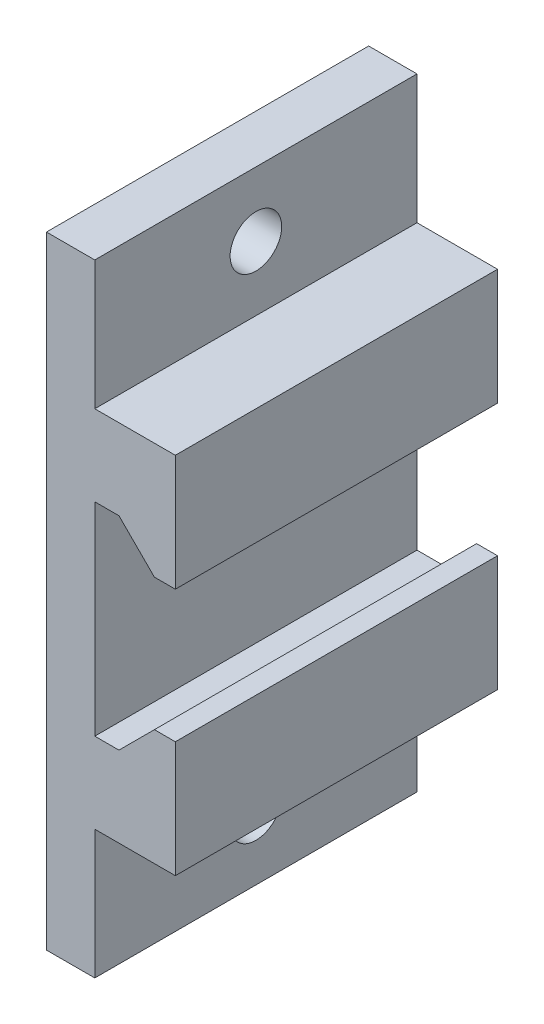
ISO-10303-21;
HEADER;
FILE_DESCRIPTION(('STEP AP214'),'2;1');
FILE_NAME('part.step','',(''),(''),'','','');
FILE_SCHEMA(('AUTOMOTIVE_DESIGN { 1 0 10303 214 1 1 1 1 }'));
ENDSEC;
DATA;
#1=APPLICATION_CONTEXT('core data for automotive mechanical design processes');
#2=APPLICATION_PROTOCOL_DEFINITION('international standard','automotive_design',2000,#1);
#3=PRODUCT_CONTEXT('',#1,'mechanical');
#4=PRODUCT('Part','Part','',(#3));
#5=PRODUCT_RELATED_PRODUCT_CATEGORY('part','',(#4));
#6=PRODUCT_DEFINITION_FORMATION('','',#4);
#7=PRODUCT_DEFINITION_CONTEXT('part definition',#1,'design');
#8=PRODUCT_DEFINITION('design','',#6,#7);
#9=PRODUCT_DEFINITION_SHAPE('','',#8);
#10=(LENGTH_UNIT() NAMED_UNIT(*) SI_UNIT(.MILLI.,.METRE.));
#11=(NAMED_UNIT(*) PLANE_ANGLE_UNIT() SI_UNIT($,.RADIAN.));
#12=(NAMED_UNIT(*) SI_UNIT($,.STERADIAN.) SOLID_ANGLE_UNIT());
#13=UNCERTAINTY_MEASURE_WITH_UNIT(LENGTH_MEASURE(1.E-05),#10,'distance_accuracy_value','');
#14=(GEOMETRIC_REPRESENTATION_CONTEXT(3) GLOBAL_UNCERTAINTY_ASSIGNED_CONTEXT((#13)) GLOBAL_UNIT_ASSIGNED_CONTEXT((#10,
#11,#12)) REPRESENTATION_CONTEXT('',''));
#15=CARTESIAN_POINT('',(0.,0.,0.));
#16=DIRECTION('',(0.,0.,1.));
#17=DIRECTION('',(1.,0.,0.));
#18=AXIS2_PLACEMENT_3D('',#15,#16,#17);
#19=CARTESIAN_POINT('',(3.,11.3,10.));
#20=DIRECTION('',(-1.,0.,0.));
#21=DIRECTION('',(0.,-1.,0.));
#22=AXIS2_PLACEMENT_3D('',#19,#20,#21);
#23=PLANE('',#22);
#24=CARTESIAN_POINT('',(3.00000000000002,15.3,0.));
#25=DIRECTION('',(1.,0.,0.));
#26=DIRECTION('',(0.,1.,0.));
#27=AXIS2_PLACEMENT_3D('',#24,#25,#26);
#28=CIRCLE('',#27,1.6);
#29=CARTESIAN_POINT('',(3.00000000000002,16.9,0.));
#30=VERTEX_POINT('',#29);
#31=EDGE_CURVE('E313',#30,#30,#28,.T.);
#32=ORIENTED_EDGE('',*,*,#31,.F.);
#33=EDGE_LOOP('',(#32));
#34=FACE_BOUND('',#33,.T.);
#35=DIRECTION('',(0.,1.,0.));
#36=VECTOR('',#35,1.);
#37=CARTESIAN_POINT('',(3.,11.3,-10.));
#38=LINE('',#37,#36);
#39=CARTESIAN_POINT('',(3.,11.3,-10.));
#40=VERTEX_POINT('',#39);
#41=CARTESIAN_POINT('',(3.,19.3,-10.));
#42=VERTEX_POINT('',#41);
#43=EDGE_CURVE('E177',#40,#42,#38,.T.);
#44=ORIENTED_EDGE('',*,*,#43,.T.);
#45=DIRECTION('',(0.,0.,-1.));
#46=VECTOR('',#45,1.);
#47=CARTESIAN_POINT('',(3.,19.3,10.));
#48=LINE('',#47,#46);
#49=CARTESIAN_POINT('',(3.,19.3,10.));
#50=VERTEX_POINT('',#49);
#51=EDGE_CURVE('E11',#50,#42,#48,.T.);
#52=ORIENTED_EDGE('',*,*,#51,.F.);
#53=DIRECTION('',(0.,1.,0.));
#54=VECTOR('',#53,1.);
#55=CARTESIAN_POINT('',(3.,11.3,10.));
#56=LINE('',#55,#54);
#57=CARTESIAN_POINT('',(3.,11.3,10.));
#58=VERTEX_POINT('',#57);
#59=EDGE_CURVE('E208',#58,#50,#56,.T.);
#60=ORIENTED_EDGE('',*,*,#59,.F.);
#61=DIRECTION('',(0.,0.,-1.));
#62=VECTOR('',#61,1.);
#63=CARTESIAN_POINT('',(3.,11.3,10.));
#64=LINE('',#63,#62);
#65=EDGE_CURVE('E173',#58,#40,#64,.T.);
#66=ORIENTED_EDGE('',*,*,#65,.T.);
#67=EDGE_LOOP('',(#44,#52,#60,#66));
#68=FACE_BOUND('',#67,.T.);
#69=ADVANCED_FACE('F33',(#34,#68),#23,.F.);
#70=CARTESIAN_POINT('',(3.,19.3,10.));
#71=DIRECTION('',(0.,-1.,0.));
#72=DIRECTION('',(0.,0.,-1.));
#73=AXIS2_PLACEMENT_3D('',#70,#71,#72);
#74=PLANE('',#73);
#75=DIRECTION('',(-1.,0.,0.));
#76=VECTOR('',#75,1.);
#77=CARTESIAN_POINT('',(3.,19.3,-10.));
#78=LINE('',#77,#76);
#79=CARTESIAN_POINT('',(0.,19.3,-10.));
#80=VERTEX_POINT('',#79);
#81=EDGE_CURVE('E180',#42,#80,#78,.T.);
#82=ORIENTED_EDGE('',*,*,#81,.T.);
#83=DIRECTION('',(0.,0.,-1.));
#84=VECTOR('',#83,1.);
#85=CARTESIAN_POINT('',(0.,19.3,10.));
#86=LINE('',#85,#84);
#87=CARTESIAN_POINT('',(0.,19.3,10.));
#88=VERTEX_POINT('',#87);
#89=EDGE_CURVE('E41',#88,#80,#86,.T.);
#90=ORIENTED_EDGE('',*,*,#89,.F.);
#91=DIRECTION('',(-1.,0.,0.));
#92=VECTOR('',#91,1.);
#93=CARTESIAN_POINT('',(3.,19.3,10.));
#94=LINE('',#93,#92);
#95=EDGE_CURVE('E116',#50,#88,#94,.T.);
#96=ORIENTED_EDGE('',*,*,#95,.F.);
#97=ORIENTED_EDGE('',*,*,#51,.T.);
#98=EDGE_LOOP('',(#82,#90,#96,#97));
#99=FACE_BOUND('',#98,.T.);
#100=ADVANCED_FACE('F306',(#99),#74,.F.);
#101=CARTESIAN_POINT('',(0.,19.3,10.));
#102=DIRECTION('',(1.,0.,0.));
#103=DIRECTION('',(0.,0.,-1.));
#104=AXIS2_PLACEMENT_3D('',#101,#102,#103);
#105=PLANE('',#104);
#106=CARTESIAN_POINT('',(0.,-15.3,0.));
#107=DIRECTION('',(1.,0.,0.));
#108=DIRECTION('',(0.,1.,0.));
#109=AXIS2_PLACEMENT_3D('',#106,#107,#108);
#110=CIRCLE('',#109,1.6);
#111=CARTESIAN_POINT('',(0.,-13.7,0.));
#112=VERTEX_POINT('',#111);
#113=EDGE_CURVE('E315',#112,#112,#110,.T.);
#114=ORIENTED_EDGE('',*,*,#113,.T.);
#115=EDGE_LOOP('',(#114));
#116=FACE_BOUND('',#115,.T.);
#117=CARTESIAN_POINT('',(0.,15.3,0.));
#118=DIRECTION('',(1.,0.,0.));
#119=DIRECTION('',(0.,1.,0.));
#120=AXIS2_PLACEMENT_3D('',#117,#118,#119);
#121=CIRCLE('',#120,1.6);
#122=CARTESIAN_POINT('',(0.,16.9,0.));
#123=VERTEX_POINT('',#122);
#124=EDGE_CURVE('E181',#123,#123,#121,.T.);
#125=ORIENTED_EDGE('',*,*,#124,.T.);
#126=EDGE_LOOP('',(#125));
#127=FACE_BOUND('',#126,.T.);
#128=DIRECTION('',(0.,-1.,0.));
#129=VECTOR('',#128,1.);
#130=CARTESIAN_POINT('',(0.,19.3,-10.));
#131=LINE('',#130,#129);
#132=CARTESIAN_POINT('',(0.,-19.3,-10.));
#133=VERTEX_POINT('',#132);
#134=EDGE_CURVE('E183',#80,#133,#131,.T.);
#135=ORIENTED_EDGE('',*,*,#134,.T.);
#136=DIRECTION('',(0.,0.,-1.));
#137=VECTOR('',#136,1.);
#138=CARTESIAN_POINT('',(0.,-19.3,10.));
#139=LINE('',#138,#137);
#140=CARTESIAN_POINT('',(0.,-19.3,10.));
#141=VERTEX_POINT('',#140);
#142=EDGE_CURVE('E239',#141,#133,#139,.T.);
#143=ORIENTED_EDGE('',*,*,#142,.F.);
#144=DIRECTION('',(0.,-1.,0.));
#145=VECTOR('',#144,1.);
#146=CARTESIAN_POINT('',(0.,19.3,10.));
#147=LINE('',#146,#145);
#148=EDGE_CURVE('E247',#88,#141,#147,.T.);
#149=ORIENTED_EDGE('',*,*,#148,.F.);
#150=ORIENTED_EDGE('',*,*,#89,.T.);
#151=EDGE_LOOP('',(#135,#143,#149,#150));
#152=FACE_BOUND('',#151,.T.);
#153=ADVANCED_FACE('F245',(#116,#127,#152),#105,.F.);
#154=CARTESIAN_POINT('',(0.,-19.3,10.));
#155=DIRECTION('',(0.,1.,0.));
#156=DIRECTION('',(0.,0.,1.));
#157=AXIS2_PLACEMENT_3D('',#154,#155,#156);
#158=PLANE('',#157);
#159=DIRECTION('',(1.,0.,0.));
#160=VECTOR('',#159,1.);
#161=CARTESIAN_POINT('',(0.,-19.3,-10.));
#162=LINE('',#161,#160);
#163=CARTESIAN_POINT('',(3.,-19.3,-10.));
#164=VERTEX_POINT('',#163);
#165=EDGE_CURVE('E185',#133,#164,#162,.T.);
#166=ORIENTED_EDGE('',*,*,#165,.T.);
#167=DIRECTION('',(0.,0.,-1.));
#168=VECTOR('',#167,1.);
#169=CARTESIAN_POINT('',(3.,-19.3,10.));
#170=LINE('',#169,#168);
#171=CARTESIAN_POINT('',(3.,-19.3,10.));
#172=VERTEX_POINT('',#171);
#173=EDGE_CURVE('E236',#172,#164,#170,.T.);
#174=ORIENTED_EDGE('',*,*,#173,.F.);
#175=DIRECTION('',(1.,0.,0.));
#176=VECTOR('',#175,1.);
#177=CARTESIAN_POINT('',(0.,-19.3,10.));
#178=LINE('',#177,#176);
#179=EDGE_CURVE('E265',#141,#172,#178,.T.);
#180=ORIENTED_EDGE('',*,*,#179,.F.);
#181=ORIENTED_EDGE('',*,*,#142,.T.);
#182=EDGE_LOOP('',(#166,#174,#180,#181));
#183=FACE_BOUND('',#182,.T.);
#184=ADVANCED_FACE('F256',(#183),#158,.F.);
#185=CARTESIAN_POINT('',(3.,-19.3,10.));
#186=DIRECTION('',(-1.,0.,0.));
#187=DIRECTION('',(0.,-1.,0.));
#188=AXIS2_PLACEMENT_3D('',#185,#186,#187);
#189=PLANE('',#188);
#190=CARTESIAN_POINT('',(2.99999999999998,-15.3,0.));
#191=DIRECTION('',(1.,0.,0.));
#192=DIRECTION('',(0.,1.,0.));
#193=AXIS2_PLACEMENT_3D('',#190,#191,#192);
#194=CIRCLE('',#193,1.6);
#195=CARTESIAN_POINT('',(2.99999999999998,-13.7,0.));
#196=VERTEX_POINT('',#195);
#197=EDGE_CURVE('E320',#196,#196,#194,.T.);
#198=ORIENTED_EDGE('',*,*,#197,.F.);
#199=EDGE_LOOP('',(#198));
#200=FACE_BOUND('',#199,.T.);
#201=DIRECTION('',(0.,1.,0.));
#202=VECTOR('',#201,1.);
#203=CARTESIAN_POINT('',(3.,-19.3,-10.));
#204=LINE('',#203,#202);
#205=CARTESIAN_POINT('',(3.,-11.3,-10.));
#206=VERTEX_POINT('',#205);
#207=EDGE_CURVE('E187',#164,#206,#204,.T.);
#208=ORIENTED_EDGE('',*,*,#207,.T.);
#209=DIRECTION('',(0.,0.,-1.));
#210=VECTOR('',#209,1.);
#211=CARTESIAN_POINT('',(3.,-11.3,10.));
#212=LINE('',#211,#210);
#213=CARTESIAN_POINT('',(3.,-11.3,10.));
#214=VERTEX_POINT('',#213);
#215=EDGE_CURVE('E233',#214,#206,#212,.T.);
#216=ORIENTED_EDGE('',*,*,#215,.F.);
#217=DIRECTION('',(0.,1.,0.));
#218=VECTOR('',#217,1.);
#219=CARTESIAN_POINT('',(3.,-19.3,10.));
#220=LINE('',#219,#218);
#221=EDGE_CURVE('E262',#172,#214,#220,.T.);
#222=ORIENTED_EDGE('',*,*,#221,.F.);
#223=ORIENTED_EDGE('',*,*,#173,.T.);
#224=EDGE_LOOP('',(#208,#216,#222,#223));
#225=FACE_BOUND('',#224,.T.);
#226=ADVANCED_FACE('F260',(#200,#225),#189,.F.);
#227=CARTESIAN_POINT('',(3.,-11.3,10.));
#228=DIRECTION('',(0.,1.,0.));
#229=DIRECTION('',(0.,0.,1.));
#230=AXIS2_PLACEMENT_3D('',#227,#228,#229);
#231=PLANE('',#230);
#232=DIRECTION('',(1.,0.,0.));
#233=VECTOR('',#232,1.);
#234=CARTESIAN_POINT('',(3.,-11.3,-10.));
#235=LINE('',#234,#233);
#236=CARTESIAN_POINT('',(8.,-11.3,-10.));
#237=VERTEX_POINT('',#236);
#238=EDGE_CURVE('E189',#206,#237,#235,.T.);
#239=ORIENTED_EDGE('',*,*,#238,.T.);
#240=DIRECTION('',(0.,0.,-1.));
#241=VECTOR('',#240,1.);
#242=CARTESIAN_POINT('',(8.,-11.3,10.));
#243=LINE('',#242,#241);
#244=CARTESIAN_POINT('',(8.,-11.3,10.));
#245=VERTEX_POINT('',#244);
#246=EDGE_CURVE('E230',#245,#237,#243,.T.);
#247=ORIENTED_EDGE('',*,*,#246,.F.);
#248=DIRECTION('',(1.,0.,0.));
#249=VECTOR('',#248,1.);
#250=CARTESIAN_POINT('',(3.,-11.3,10.));
#251=LINE('',#250,#249);
#252=EDGE_CURVE('E264',#214,#245,#251,.T.);
#253=ORIENTED_EDGE('',*,*,#252,.F.);
#254=ORIENTED_EDGE('',*,*,#215,.T.);
#255=EDGE_LOOP('',(#239,#247,#253,#254));
#256=FACE_BOUND('',#255,.T.);
#257=ADVANCED_FACE('F331',(#256),#231,.F.);
#258=CARTESIAN_POINT('',(8.,-11.3,10.));
#259=DIRECTION('',(-1.,0.,0.));
#260=DIRECTION('',(0.,-1.,0.));
#261=AXIS2_PLACEMENT_3D('',#258,#259,#260);
#262=PLANE('',#261);
#263=DIRECTION('',(0.,1.,0.));
#264=VECTOR('',#263,1.);
#265=CARTESIAN_POINT('',(8.,-11.3,-10.));
#266=LINE('',#265,#264);
#267=CARTESIAN_POINT('',(8.,-4.1,-10.));
#268=VERTEX_POINT('',#267);
#269=EDGE_CURVE('E191',#237,#268,#266,.T.);
#270=ORIENTED_EDGE('',*,*,#269,.T.);
#271=DIRECTION('',(0.,0.,-1.));
#272=VECTOR('',#271,1.);
#273=CARTESIAN_POINT('',(8.,-4.1,10.));
#274=LINE('',#273,#272);
#275=CARTESIAN_POINT('',(8.,-4.1,10.));
#276=VERTEX_POINT('',#275);
#277=EDGE_CURVE('E227',#276,#268,#274,.T.);
#278=ORIENTED_EDGE('',*,*,#277,.F.);
#279=DIRECTION('',(0.,1.,0.));
#280=VECTOR('',#279,1.);
#281=CARTESIAN_POINT('',(8.,-11.3,10.));
#282=LINE('',#281,#280);
#283=EDGE_CURVE('E267',#245,#276,#282,.T.);
#284=ORIENTED_EDGE('',*,*,#283,.F.);
#285=ORIENTED_EDGE('',*,*,#246,.T.);
#286=EDGE_LOOP('',(#270,#278,#284,#285));
#287=FACE_BOUND('',#286,.T.);
#288=ADVANCED_FACE('F337',(#287),#262,.F.);
#289=CARTESIAN_POINT('',(6.7,-4.1,10.));
#290=DIRECTION('',(0.,-1.,0.));
#291=DIRECTION('',(0.,0.,-1.));
#292=AXIS2_PLACEMENT_3D('',#289,#290,#291);
#293=PLANE('',#292);
#294=DIRECTION('',(-1.,0.,0.));
#295=VECTOR('',#294,1.);
#296=CARTESIAN_POINT('',(6.7,-4.1,-10.));
#297=LINE('',#296,#295);
#298=CARTESIAN_POINT('',(6.7,-4.1,-10.));
#299=VERTEX_POINT('',#298);
#300=EDGE_CURVE('E193',#268,#299,#297,.T.);
#301=ORIENTED_EDGE('',*,*,#300,.T.);
#302=DIRECTION('',(0.,0.,-1.));
#303=VECTOR('',#302,1.);
#304=CARTESIAN_POINT('',(6.7,-4.1,10.));
#305=LINE('',#304,#303);
#306=CARTESIAN_POINT('',(6.7,-4.1,10.));
#307=VERTEX_POINT('',#306);
#308=EDGE_CURVE('E224',#307,#299,#305,.T.);
#309=ORIENTED_EDGE('',*,*,#308,.F.);
#310=DIRECTION('',(-1.,0.,0.));
#311=VECTOR('',#310,1.);
#312=CARTESIAN_POINT('',(6.7,-4.1,10.));
#313=LINE('',#312,#311);
#314=EDGE_CURVE('E273',#276,#307,#313,.T.);
#315=ORIENTED_EDGE('',*,*,#314,.F.);
#316=ORIENTED_EDGE('',*,*,#277,.T.);
#317=EDGE_LOOP('',(#301,#309,#315,#316));
#318=FACE_BOUND('',#317,.T.);
#319=ADVANCED_FACE('F430',(#318),#293,.F.);
#320=CARTESIAN_POINT('',(4.5,-6.3,10.));
#321=DIRECTION('',(0.707106781186547,-0.707106781186548,0.));
#322=DIRECTION('',(0.707106781186548,0.707106781186547,0.));
#323=AXIS2_PLACEMENT_3D('',#320,#321,#322);
#324=PLANE('',#323);
#325=DIRECTION('',(-0.707106781186548,-0.707106781186547,0.));
#326=VECTOR('',#325,1.);
#327=CARTESIAN_POINT('',(4.5,-6.3,-10.));
#328=LINE('',#327,#326);
#329=CARTESIAN_POINT('',(4.5,-6.3,-10.));
#330=VERTEX_POINT('',#329);
#331=EDGE_CURVE('E195',#299,#330,#328,.T.);
#332=ORIENTED_EDGE('',*,*,#331,.T.);
#333=DIRECTION('',(0.,0.,-1.));
#334=VECTOR('',#333,1.);
#335=CARTESIAN_POINT('',(4.5,-6.3,10.));
#336=LINE('',#335,#334);
#337=CARTESIAN_POINT('',(4.5,-6.3,10.));
#338=VERTEX_POINT('',#337);
#339=EDGE_CURVE('E221',#338,#330,#336,.T.);
#340=ORIENTED_EDGE('',*,*,#339,.F.);
#341=DIRECTION('',(-0.707106781186548,-0.707106781186547,0.));
#342=VECTOR('',#341,1.);
#343=CARTESIAN_POINT('',(4.5,-6.3,10.));
#344=LINE('',#343,#342);
#345=EDGE_CURVE('E275',#307,#338,#344,.T.);
#346=ORIENTED_EDGE('',*,*,#345,.F.);
#347=ORIENTED_EDGE('',*,*,#308,.T.);
#348=EDGE_LOOP('',(#332,#340,#346,#347));
#349=FACE_BOUND('',#348,.T.);
#350=ADVANCED_FACE('F420',(#349),#324,.F.);
#351=CARTESIAN_POINT('',(4.5,-6.3,10.));
#352=DIRECTION('',(0.,-1.,0.));
#353=DIRECTION('',(1.,0.,0.));
#354=AXIS2_PLACEMENT_3D('',#351,#352,#353);
#355=PLANE('',#354);
#356=DIRECTION('',(-1.,0.,0.));
#357=VECTOR('',#356,1.);
#358=CARTESIAN_POINT('',(4.5,-6.3,-10.));
#359=LINE('',#358,#357);
#360=CARTESIAN_POINT('',(3.,-6.29999999999999,-10.));
#361=VERTEX_POINT('',#360);
#362=EDGE_CURVE('E197',#330,#361,#359,.T.);
#363=ORIENTED_EDGE('',*,*,#362,.T.);
#364=DIRECTION('',(0.,0.,-1.));
#365=VECTOR('',#364,1.);
#366=CARTESIAN_POINT('',(3.,-6.29999999999999,10.));
#367=LINE('',#366,#365);
#368=CARTESIAN_POINT('',(3.,-6.29999999999999,10.));
#369=VERTEX_POINT('',#368);
#370=EDGE_CURVE('E218',#369,#361,#367,.T.);
#371=ORIENTED_EDGE('',*,*,#370,.F.);
#372=DIRECTION('',(-1.,0.,0.));
#373=VECTOR('',#372,1.);
#374=CARTESIAN_POINT('',(4.5,-6.3,10.));
#375=LINE('',#374,#373);
#376=EDGE_CURVE('E277',#338,#369,#375,.T.);
#377=ORIENTED_EDGE('',*,*,#376,.F.);
#378=ORIENTED_EDGE('',*,*,#339,.T.);
#379=EDGE_LOOP('',(#363,#371,#377,#378));
#380=FACE_BOUND('',#379,.T.);
#381=ADVANCED_FACE('F410',(#380),#355,.F.);
#382=CARTESIAN_POINT('',(3.,-6.29999999999999,10.));
#383=DIRECTION('',(-1.,0.,0.));
#384=DIRECTION('',(0.,-1.,0.));
#385=AXIS2_PLACEMENT_3D('',#382,#383,#384);
#386=PLANE('',#385);
#387=DIRECTION('',(0.,1.,0.));
#388=VECTOR('',#387,1.);
#389=CARTESIAN_POINT('',(3.,-6.29999999999999,-10.));
#390=LINE('',#389,#388);
#391=CARTESIAN_POINT('',(3.,6.30000000000001,-10.));
#392=VERTEX_POINT('',#391);
#393=EDGE_CURVE('E199',#361,#392,#390,.T.);
#394=ORIENTED_EDGE('',*,*,#393,.T.);
#395=DIRECTION('',(0.,0.,-1.));
#396=VECTOR('',#395,1.);
#397=CARTESIAN_POINT('',(3.,6.30000000000001,10.));
#398=LINE('',#397,#396);
#399=CARTESIAN_POINT('',(3.,6.30000000000001,10.));
#400=VERTEX_POINT('',#399);
#401=EDGE_CURVE('E215',#400,#392,#398,.T.);
#402=ORIENTED_EDGE('',*,*,#401,.F.);
#403=DIRECTION('',(0.,1.,0.));
#404=VECTOR('',#403,1.);
#405=CARTESIAN_POINT('',(3.,-6.29999999999999,10.));
#406=LINE('',#405,#404);
#407=EDGE_CURVE('E279',#369,#400,#406,.T.);
#408=ORIENTED_EDGE('',*,*,#407,.F.);
#409=ORIENTED_EDGE('',*,*,#370,.T.);
#410=EDGE_LOOP('',(#394,#402,#408,#409));
#411=FACE_BOUND('',#410,.T.);
#412=ADVANCED_FACE('F401',(#411),#386,.F.);
#413=CARTESIAN_POINT('',(3.,6.30000000000001,10.));
#414=DIRECTION('',(0.,1.,0.));
#415=DIRECTION('',(0.,0.,1.));
#416=AXIS2_PLACEMENT_3D('',#413,#414,#415);
#417=PLANE('',#416);
#418=DIRECTION('',(1.,0.,0.));
#419=VECTOR('',#418,1.);
#420=CARTESIAN_POINT('',(3.,6.30000000000001,-10.));
#421=LINE('',#420,#419);
#422=CARTESIAN_POINT('',(4.5,6.30000000000001,-10.));
#423=VERTEX_POINT('',#422);
#424=EDGE_CURVE('E201',#392,#423,#421,.T.);
#425=ORIENTED_EDGE('',*,*,#424,.T.);
#426=DIRECTION('',(0.,0.,-1.));
#427=VECTOR('',#426,1.);
#428=CARTESIAN_POINT('',(4.5,6.30000000000001,10.));
#429=LINE('',#428,#427);
#430=CARTESIAN_POINT('',(4.5,6.30000000000001,10.));
#431=VERTEX_POINT('',#430);
#432=EDGE_CURVE('E212',#431,#423,#429,.T.);
#433=ORIENTED_EDGE('',*,*,#432,.F.);
#434=DIRECTION('',(1.,0.,0.));
#435=VECTOR('',#434,1.);
#436=CARTESIAN_POINT('',(3.,6.30000000000001,10.));
#437=LINE('',#436,#435);
#438=EDGE_CURVE('E281',#400,#431,#437,.T.);
#439=ORIENTED_EDGE('',*,*,#438,.F.);
#440=ORIENTED_EDGE('',*,*,#401,.T.);
#441=EDGE_LOOP('',(#425,#433,#439,#440));
#442=FACE_BOUND('',#441,.T.);
#443=ADVANCED_FACE('F287',(#442),#417,.F.);
#444=CARTESIAN_POINT('',(4.5,6.30000000000001,10.));
#445=DIRECTION('',(0.707106781186548,0.707106781186547,0.));
#446=DIRECTION('',(-0.707106781186547,0.707106781186548,0.));
#447=AXIS2_PLACEMENT_3D('',#444,#445,#446);
#448=PLANE('',#447);
#449=DIRECTION('',(0.707106781186547,-0.707106781186549,0.));
#450=VECTOR('',#449,1.);
#451=CARTESIAN_POINT('',(4.5,6.30000000000001,-10.));
#452=LINE('',#451,#450);
#453=CARTESIAN_POINT('',(6.7,4.1,-10.));
#454=VERTEX_POINT('',#453);
#455=EDGE_CURVE('E203',#423,#454,#452,.T.);
#456=ORIENTED_EDGE('',*,*,#455,.T.);
#457=DIRECTION('',(0.,0.,-1.));
#458=VECTOR('',#457,1.);
#459=CARTESIAN_POINT('',(6.7,4.1,10.));
#460=LINE('',#459,#458);
#461=CARTESIAN_POINT('',(6.7,4.1,10.));
#462=VERTEX_POINT('',#461);
#463=EDGE_CURVE('E168',#462,#454,#460,.T.);
#464=ORIENTED_EDGE('',*,*,#463,.F.);
#465=DIRECTION('',(0.707106781186547,-0.707106781186549,0.));
#466=VECTOR('',#465,1.);
#467=CARTESIAN_POINT('',(4.5,6.30000000000001,10.));
#468=LINE('',#467,#466);
#469=EDGE_CURVE('E159',#431,#462,#468,.T.);
#470=ORIENTED_EDGE('',*,*,#469,.F.);
#471=ORIENTED_EDGE('',*,*,#432,.T.);
#472=EDGE_LOOP('',(#456,#464,#470,#471));
#473=FACE_BOUND('',#472,.T.);
#474=ADVANCED_FACE('F291',(#473),#448,.F.);
#475=CARTESIAN_POINT('',(6.7,4.1,10.));
#476=DIRECTION('',(0.,1.,0.));
#477=DIRECTION('',(0.,0.,1.));
#478=AXIS2_PLACEMENT_3D('',#475,#476,#477);
#479=PLANE('',#478);
#480=DIRECTION('',(1.,0.,0.));
#481=VECTOR('',#480,1.);
#482=CARTESIAN_POINT('',(6.7,4.1,-10.));
#483=LINE('',#482,#481);
#484=CARTESIAN_POINT('',(8.,4.1,-10.));
#485=VERTEX_POINT('',#484);
#486=EDGE_CURVE('E167',#454,#485,#483,.T.);
#487=ORIENTED_EDGE('',*,*,#486,.T.);
#488=DIRECTION('',(0.,0.,-1.));
#489=VECTOR('',#488,1.);
#490=CARTESIAN_POINT('',(8.,4.1,10.));
#491=LINE('',#490,#489);
#492=CARTESIAN_POINT('',(8.,4.1,10.));
#493=VERTEX_POINT('',#492);
#494=EDGE_CURVE('E164',#493,#485,#491,.T.);
#495=ORIENTED_EDGE('',*,*,#494,.F.);
#496=DIRECTION('',(1.,0.,0.));
#497=VECTOR('',#496,1.);
#498=CARTESIAN_POINT('',(6.7,4.1,10.));
#499=LINE('',#498,#497);
#500=EDGE_CURVE('E153',#462,#493,#499,.T.);
#501=ORIENTED_EDGE('',*,*,#500,.F.);
#502=ORIENTED_EDGE('',*,*,#463,.T.);
#503=EDGE_LOOP('',(#487,#495,#501,#502));
#504=FACE_BOUND('',#503,.T.);
#505=ADVANCED_FACE('F165',(#504),#479,.F.);
#506=CARTESIAN_POINT('',(8.,4.1,10.));
#507=DIRECTION('',(-1.,0.,0.));
#508=DIRECTION('',(0.,-1.,0.));
#509=AXIS2_PLACEMENT_3D('',#506,#507,#508);
#510=PLANE('',#509);
#511=DIRECTION('',(0.,1.,0.));
#512=VECTOR('',#511,1.);
#513=CARTESIAN_POINT('',(8.,4.1,-10.));
#514=LINE('',#513,#512);
#515=CARTESIAN_POINT('',(8.,11.3,-10.));
#516=VERTEX_POINT('',#515);
#517=EDGE_CURVE('E102',#485,#516,#514,.T.);
#518=ORIENTED_EDGE('',*,*,#517,.T.);
#519=DIRECTION('',(0.,0.,-1.));
#520=VECTOR('',#519,1.);
#521=CARTESIAN_POINT('',(8.,11.3,10.));
#522=LINE('',#521,#520);
#523=CARTESIAN_POINT('',(8.,11.3,10.));
#524=VERTEX_POINT('',#523);
#525=EDGE_CURVE('E169',#524,#516,#522,.T.);
#526=ORIENTED_EDGE('',*,*,#525,.F.);
#527=DIRECTION('',(0.,1.,0.));
#528=VECTOR('',#527,1.);
#529=CARTESIAN_POINT('',(8.,4.1,10.));
#530=LINE('',#529,#528);
#531=EDGE_CURVE('E157',#493,#524,#530,.T.);
#532=ORIENTED_EDGE('',*,*,#531,.F.);
#533=ORIENTED_EDGE('',*,*,#494,.T.);
#534=EDGE_LOOP('',(#518,#526,#532,#533));
#535=FACE_BOUND('',#534,.T.);
#536=ADVANCED_FACE('F171',(#535),#510,.F.);
#537=CARTESIAN_POINT('',(8.,11.3,10.));
#538=DIRECTION('',(0.,-1.,0.));
#539=DIRECTION('',(0.,0.,-1.));
#540=AXIS2_PLACEMENT_3D('',#537,#538,#539);
#541=PLANE('',#540);
#542=DIRECTION('',(-1.,0.,0.));
#543=VECTOR('',#542,1.);
#544=CARTESIAN_POINT('',(8.,11.3,-10.));
#545=LINE('',#544,#543);
#546=EDGE_CURVE('E108',#516,#40,#545,.T.);
#547=ORIENTED_EDGE('',*,*,#546,.T.);
#548=ORIENTED_EDGE('',*,*,#65,.F.);
#549=DIRECTION('',(-1.,0.,0.));
#550=VECTOR('',#549,1.);
#551=CARTESIAN_POINT('',(8.,11.3,10.));
#552=LINE('',#551,#550);
#553=EDGE_CURVE('E49',#524,#58,#552,.T.);
#554=ORIENTED_EDGE('',*,*,#553,.F.);
#555=ORIENTED_EDGE('',*,*,#525,.T.);
#556=EDGE_LOOP('',(#547,#548,#554,#555));
#557=FACE_BOUND('',#556,.T.);
#558=ADVANCED_FACE('F295',(#557),#541,.F.);
#559=CARTESIAN_POINT('',(0.,0.,10.));
#560=DIRECTION('',(0.,0.,1.));
#561=DIRECTION('',(1.,0.,0.));
#562=AXIS2_PLACEMENT_3D('',#559,#560,#561);
#563=PLANE('',#562);
#564=ORIENTED_EDGE('',*,*,#59,.T.);
#565=ORIENTED_EDGE('',*,*,#95,.T.);
#566=ORIENTED_EDGE('',*,*,#148,.T.);
#567=ORIENTED_EDGE('',*,*,#179,.T.);
#568=ORIENTED_EDGE('',*,*,#221,.T.);
#569=ORIENTED_EDGE('',*,*,#252,.T.);
#570=ORIENTED_EDGE('',*,*,#283,.T.);
#571=ORIENTED_EDGE('',*,*,#314,.T.);
#572=ORIENTED_EDGE('',*,*,#345,.T.);
#573=ORIENTED_EDGE('',*,*,#376,.T.);
#574=ORIENTED_EDGE('',*,*,#407,.T.);
#575=ORIENTED_EDGE('',*,*,#438,.T.);
#576=ORIENTED_EDGE('',*,*,#469,.T.);
#577=ORIENTED_EDGE('',*,*,#500,.T.);
#578=ORIENTED_EDGE('',*,*,#531,.T.);
#579=ORIENTED_EDGE('',*,*,#553,.T.);
#580=EDGE_LOOP('',(#564,#565,#566,#567,#568,#569,#570,#571,#572,#573,#574,#575,#576,#577,#578,#579));
#581=FACE_BOUND('',#580,.T.);
#582=ADVANCED_FACE('F155',(#581),#563,.T.);
#583=CARTESIAN_POINT('',(0.,0.,-10.));
#584=DIRECTION('',(0.,0.,1.));
#585=DIRECTION('',(1.,0.,0.));
#586=AXIS2_PLACEMENT_3D('',#583,#584,#585);
#587=PLANE('',#586);
#588=ORIENTED_EDGE('',*,*,#43,.F.);
#589=ORIENTED_EDGE('',*,*,#546,.F.);
#590=ORIENTED_EDGE('',*,*,#517,.F.);
#591=ORIENTED_EDGE('',*,*,#486,.F.);
#592=ORIENTED_EDGE('',*,*,#455,.F.);
#593=ORIENTED_EDGE('',*,*,#424,.F.);
#594=ORIENTED_EDGE('',*,*,#393,.F.);
#595=ORIENTED_EDGE('',*,*,#362,.F.);
#596=ORIENTED_EDGE('',*,*,#331,.F.);
#597=ORIENTED_EDGE('',*,*,#300,.F.);
#598=ORIENTED_EDGE('',*,*,#269,.F.);
#599=ORIENTED_EDGE('',*,*,#238,.F.);
#600=ORIENTED_EDGE('',*,*,#207,.F.);
#601=ORIENTED_EDGE('',*,*,#165,.F.);
#602=ORIENTED_EDGE('',*,*,#134,.F.);
#603=ORIENTED_EDGE('',*,*,#81,.F.);
#604=EDGE_LOOP('',(#588,#589,#590,#591,#592,#593,#594,#595,#596,#597,#598,#599,#600,#601,#602,#603));
#605=FACE_BOUND('',#604,.T.);
#606=ADVANCED_FACE('F251',(#605),#587,.F.);
#607=CARTESIAN_POINT('',(0.,15.3,0.));
#608=DIRECTION('',(1.,0.,0.));
#609=DIRECTION('',(0.,1.,0.));
#610=AXIS2_PLACEMENT_3D('',#607,#608,#609);
#611=CYLINDRICAL_SURFACE('',#610,1.6);
#612=ORIENTED_EDGE('',*,*,#124,.F.);
#613=EDGE_LOOP('',(#612));
#614=FACE_BOUND('',#613,.T.);
#615=ORIENTED_EDGE('',*,*,#31,.T.);
#616=EDGE_LOOP('',(#615));
#617=FACE_BOUND('',#616,.T.);
#618=ADVANCED_FACE('F351',(#614,#617),#611,.F.);
#619=CARTESIAN_POINT('',(0.,-15.3,0.));
#620=DIRECTION('',(1.,0.,0.));
#621=DIRECTION('',(0.,1.,0.));
#622=AXIS2_PLACEMENT_3D('',#619,#620,#621);
#623=CYLINDRICAL_SURFACE('',#622,1.6);
#624=ORIENTED_EDGE('',*,*,#113,.F.);
#625=EDGE_LOOP('',(#624));
#626=FACE_BOUND('',#625,.T.);
#627=ORIENTED_EDGE('',*,*,#197,.T.);
#628=EDGE_LOOP('',(#627));
#629=FACE_BOUND('',#628,.T.);
#630=ADVANCED_FACE('F328',(#626,#629),#623,.F.);
#631=CLOSED_SHELL('',(#69,#100,#153,#184,#226,#257,#288,#319,#350,#381,#412,#443,#474,#505,#536,
#558,#582,#606,#618,#630));
#632=MANIFOLD_SOLID_BREP('B2',#631);
#633=ADVANCED_BREP_SHAPE_REPRESENTATION('',(#18,#632),#14);
#634=SHAPE_DEFINITION_REPRESENTATION(#9,#633);
ENDSEC;
END-ISO-10303-21;
